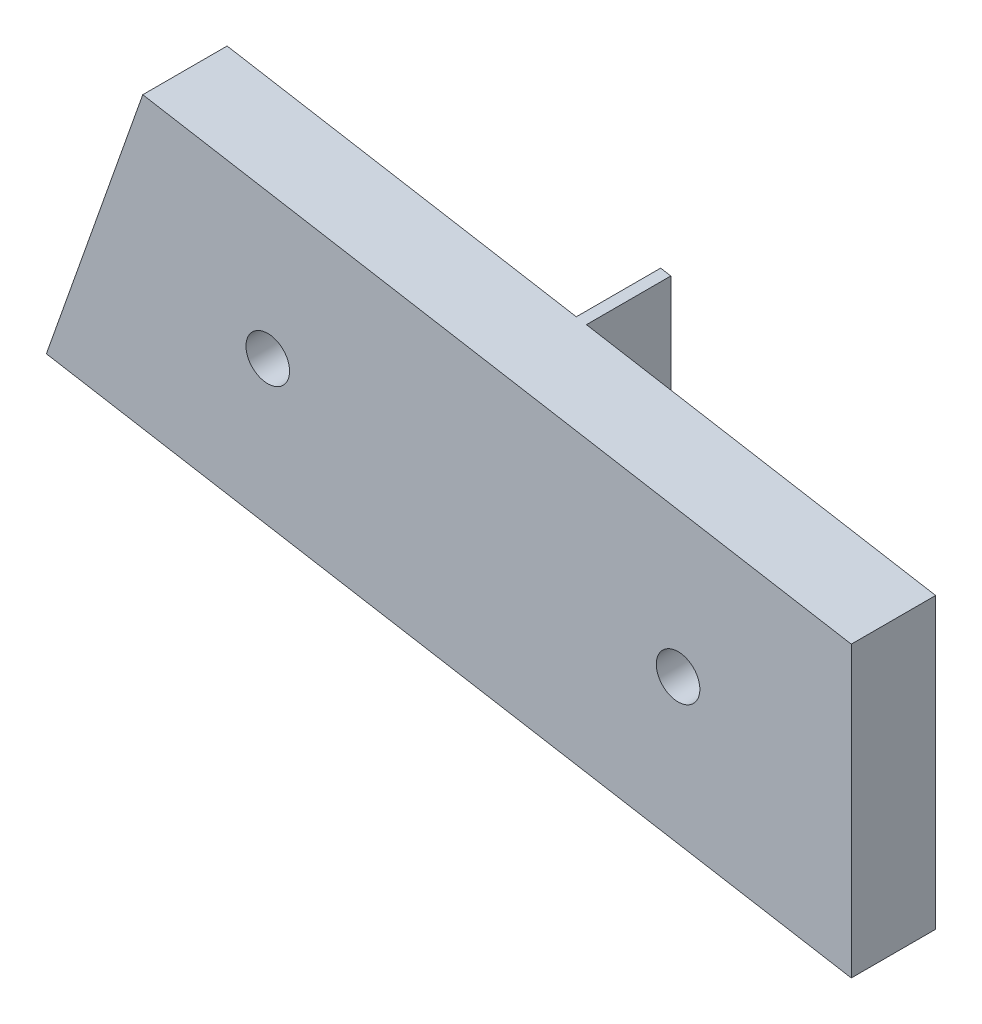
ISO-10303-21;
HEADER;
FILE_DESCRIPTION(('STEP AP214'),'2;1');
FILE_NAME('part.step','',(''),(''),'','','');
FILE_SCHEMA(('AUTOMOTIVE_DESIGN { 1 0 10303 214 1 1 1 1 }'));
ENDSEC;
DATA;
#1=APPLICATION_CONTEXT('core data for automotive mechanical design processes');
#2=APPLICATION_PROTOCOL_DEFINITION('international standard','automotive_design',2000,#1);
#3=PRODUCT_CONTEXT('',#1,'mechanical');
#4=PRODUCT('Part','Part','',(#3));
#5=PRODUCT_RELATED_PRODUCT_CATEGORY('part','',(#4));
#6=PRODUCT_DEFINITION_FORMATION('','',#4);
#7=PRODUCT_DEFINITION_CONTEXT('part definition',#1,'design');
#8=PRODUCT_DEFINITION('design','',#6,#7);
#9=PRODUCT_DEFINITION_SHAPE('','',#8);
#10=(LENGTH_UNIT() NAMED_UNIT(*) SI_UNIT(.MILLI.,.METRE.));
#11=(NAMED_UNIT(*) PLANE_ANGLE_UNIT() SI_UNIT($,.RADIAN.));
#12=(NAMED_UNIT(*) SI_UNIT($,.STERADIAN.) SOLID_ANGLE_UNIT());
#13=UNCERTAINTY_MEASURE_WITH_UNIT(LENGTH_MEASURE(1.E-05),#10,'distance_accuracy_value','');
#14=(GEOMETRIC_REPRESENTATION_CONTEXT(3) GLOBAL_UNCERTAINTY_ASSIGNED_CONTEXT((#13)) GLOBAL_UNIT_ASSIGNED_CONTEXT((#10,
#11,#12)) REPRESENTATION_CONTEXT('',''));
#15=CARTESIAN_POINT('',(0.,0.,0.));
#16=DIRECTION('',(0.,0.,1.));
#17=DIRECTION('',(1.,0.,0.));
#18=AXIS2_PLACEMENT_3D('',#15,#16,#17);
#19=CARTESIAN_POINT('',(0.,0.,0.));
#20=DIRECTION('',(0.,0.,-1.));
#21=DIRECTION('',(-1.,0.,0.));
#22=AXIS2_PLACEMENT_3D('',#19,#20,#21);
#23=PLANE('',#22);
#24=CARTESIAN_POINT('',(-155.827251007202,143.218500086852,0.));
#25=DIRECTION('',(0.,0.,-1.));
#26=DIRECTION('',(-1.,0.,0.));
#27=AXIS2_PLACEMENT_3D('',#24,#25,#26);
#28=CIRCLE('',#27,1.54999999999999);
#29=CARTESIAN_POINT('',(-157.377251007202,143.218500086852,0.));
#30=VERTEX_POINT('',#29);
#31=EDGE_CURVE('E161',#30,#30,#28,.T.);
#32=ORIENTED_EDGE('',*,*,#31,.F.);
#33=EDGE_LOOP('',(#32));
#34=FACE_BOUND('',#33,.T.);
#35=DIRECTION('',(0.333391923739183,0.942788324697271,0.));
#36=VECTOR('',#35,1.);
#37=CARTESIAN_POINT('',(-139.882193768128,150.764510209751,0.));
#38=LINE('',#37,#36);
#39=CARTESIAN_POINT('',(-146.738238305877,131.376521828693,0.));
#40=VERTEX_POINT('',#39);
#41=CARTESIAN_POINT('',(-139.882193768128,150.764510209751,0.));
#42=VERTEX_POINT('',#41);
#43=EDGE_CURVE('E121',#40,#42,#38,.T.);
#44=ORIENTED_EDGE('',*,*,#43,.F.);
#45=DIRECTION('',(0.985593304740158,-0.169132603750353,0.));
#46=VECTOR('',#45,1.);
#47=CARTESIAN_POINT('',(-114.323496857784,125.81399457263,0.));
#48=LINE('',#47,#46);
#49=CARTESIAN_POINT('',(-171.575189585329,135.638663443202,0.));
#50=VERTEX_POINT('',#49);
#51=EDGE_CURVE('E182',#50,#40,#48,.T.);
#52=ORIENTED_EDGE('',*,*,#51,.F.);
#53=DIRECTION('',(-0.333391923739182,-0.942788324697271,0.));
#54=VECTOR('',#53,1.);
#55=CARTESIAN_POINT('',(-171.575189585329,135.638663443202,0.));
#56=LINE('',#55,#54);
#57=CARTESIAN_POINT('',(-164.71914504758,155.02665182426,0.));
#58=VERTEX_POINT('',#57);
#59=EDGE_CURVE('E192',#58,#50,#56,.T.);
#60=ORIENTED_EDGE('',*,*,#59,.F.);
#61=DIRECTION('',(-0.985593304740157,0.169132603750358,0.));
#62=VECTOR('',#61,1.);
#63=CARTESIAN_POINT('',(-164.71914504758,155.02665182426,0.));
#64=LINE('',#63,#62);
#65=EDGE_CURVE('E50',#42,#58,#64,.T.);
#66=ORIENTED_EDGE('',*,*,#65,.F.);
#67=EDGE_LOOP('',(#44,#52,#60,#66));
#68=FACE_BOUND('',#67,.T.);
#69=ADVANCED_FACE('F33',(#34,#68),#23,.T.);
#70=CARTESIAN_POINT('',(-114.323496857784,146.37851353534,6.));
#71=DIRECTION('',(-1.,0.,0.));
#72=DIRECTION('',(0.,-1.,0.));
#73=AXIS2_PLACEMENT_3D('',#70,#71,#72);
#74=PLANE('',#73);
#75=DIRECTION('',(0.,1.,0.));
#76=VECTOR('',#75,1.);
#77=CARTESIAN_POINT('',(-114.323496857784,146.37851353534,0.));
#78=LINE('',#77,#76);
#79=CARTESIAN_POINT('',(-114.323496857784,125.81399457263,0.));
#80=VERTEX_POINT('',#79);
#81=CARTESIAN_POINT('',(-114.323496857784,146.37851353534,0.));
#82=VERTEX_POINT('',#81);
#83=EDGE_CURVE('E122',#80,#82,#78,.T.);
#84=ORIENTED_EDGE('',*,*,#83,.T.);
#85=DIRECTION('',(0.,0.,-1.));
#86=VECTOR('',#85,1.);
#87=CARTESIAN_POINT('',(-114.323496857784,146.37851353534,6.));
#88=LINE('',#87,#86);
#89=CARTESIAN_POINT('',(-114.323496857784,146.37851353534,6.));
#90=VERTEX_POINT('',#89);
#91=EDGE_CURVE('E11',#90,#82,#88,.T.);
#92=ORIENTED_EDGE('',*,*,#91,.F.);
#93=DIRECTION('',(0.,1.,0.));
#94=VECTOR('',#93,1.);
#95=CARTESIAN_POINT('',(-114.323496857784,146.37851353534,6.));
#96=LINE('',#95,#94);
#97=CARTESIAN_POINT('',(-114.323496857784,125.81399457263,6.));
#98=VERTEX_POINT('',#97);
#99=EDGE_CURVE('E142',#98,#90,#96,.T.);
#100=ORIENTED_EDGE('',*,*,#99,.F.);
#101=DIRECTION('',(0.,0.,-1.));
#102=VECTOR('',#101,1.);
#103=CARTESIAN_POINT('',(-114.323496857784,125.81399457263,6.));
#104=LINE('',#103,#102);
#105=EDGE_CURVE('E199',#98,#80,#104,.T.);
#106=ORIENTED_EDGE('',*,*,#105,.T.);
#107=EDGE_LOOP('',(#84,#92,#100,#106));
#108=FACE_BOUND('',#107,.T.);
#109=ADVANCED_FACE('F35',(#108),#74,.F.);
#110=CARTESIAN_POINT('',(-164.71914504758,155.02665182426,6.));
#111=DIRECTION('',(-0.169132603750358,-0.985593304740157,0.));
#112=DIRECTION('',(0.985593304740157,-0.169132603750358,0.));
#113=AXIS2_PLACEMENT_3D('',#110,#111,#112);
#114=PLANE('',#113);
#115=CARTESIAN_POINT('',(-139.160448137236,150.640655149849,0.));
#116=VERTEX_POINT('',#115);
#117=EDGE_CURVE('E210',#82,#116,#64,.T.);
#118=ORIENTED_EDGE('',*,*,#117,.T.);
#119=DIRECTION('',(0.,0.,1.));
#120=VECTOR('',#119,1.);
#121=CARTESIAN_POINT('',(-139.160448137236,150.640655149849,-6.));
#122=LINE('',#121,#120);
#123=CARTESIAN_POINT('',(-139.160448137236,150.640655149849,-6.));
#124=VERTEX_POINT('',#123);
#125=EDGE_CURVE('E106',#124,#116,#122,.T.);
#126=ORIENTED_EDGE('',*,*,#125,.F.);
#127=DIRECTION('',(0.985593304740162,-0.16913260375033,0.));
#128=VECTOR('',#127,1.);
#129=CARTESIAN_POINT('',(-139.160448137236,150.640655149849,-6.));
#130=LINE('',#129,#128);
#131=CARTESIAN_POINT('',(-139.882193768128,150.764510209751,-6.));
#132=VERTEX_POINT('',#131);
#133=EDGE_CURVE('E99',#132,#124,#130,.T.);
#134=ORIENTED_EDGE('',*,*,#133,.F.);
#135=DIRECTION('',(0.,0.,1.));
#136=VECTOR('',#135,1.);
#137=CARTESIAN_POINT('',(-139.882193768128,150.764510209751,-6.));
#138=LINE('',#137,#136);
#139=EDGE_CURVE('E103',#132,#42,#138,.T.);
#140=ORIENTED_EDGE('',*,*,#139,.T.);
#141=ORIENTED_EDGE('',*,*,#65,.T.);
#142=DIRECTION('',(0.,0.,-1.));
#143=VECTOR('',#142,1.);
#144=CARTESIAN_POINT('',(-164.71914504758,155.02665182426,6.));
#145=LINE('',#144,#143);
#146=CARTESIAN_POINT('',(-164.71914504758,155.02665182426,6.));
#147=VERTEX_POINT('',#146);
#148=EDGE_CURVE('E42',#147,#58,#145,.T.);
#149=ORIENTED_EDGE('',*,*,#148,.F.);
#150=DIRECTION('',(-0.985593304740157,0.169132603750358,0.));
#151=VECTOR('',#150,1.);
#152=CARTESIAN_POINT('',(-164.71914504758,155.02665182426,6.));
#153=LINE('',#152,#151);
#154=EDGE_CURVE('E191',#90,#147,#153,.T.);
#155=ORIENTED_EDGE('',*,*,#154,.F.);
#156=ORIENTED_EDGE('',*,*,#91,.T.);
#157=EDGE_LOOP('',(#118,#126,#134,#140,#141,#149,#155,#156));
#158=FACE_BOUND('',#157,.T.);
#159=ADVANCED_FACE('F101',(#158),#114,.F.);
#160=CARTESIAN_POINT('',(-171.575189585329,135.638663443202,6.));
#161=DIRECTION('',(0.942788324697271,-0.333391923739182,0.));
#162=DIRECTION('',(0.333391923739182,0.942788324697271,0.));
#163=AXIS2_PLACEMENT_3D('',#160,#161,#162);
#164=PLANE('',#163);
#165=ORIENTED_EDGE('',*,*,#59,.T.);
#166=DIRECTION('',(0.,0.,-1.));
#167=VECTOR('',#166,1.);
#168=CARTESIAN_POINT('',(-171.575189585329,135.638663443202,6.));
#169=LINE('',#168,#167);
#170=CARTESIAN_POINT('',(-171.575189585329,135.638663443202,6.));
#171=VERTEX_POINT('',#170);
#172=EDGE_CURVE('E187',#171,#50,#169,.T.);
#173=ORIENTED_EDGE('',*,*,#172,.F.);
#174=DIRECTION('',(-0.333391923739182,-0.942788324697271,0.));
#175=VECTOR('',#174,1.);
#176=CARTESIAN_POINT('',(-171.575189585329,135.638663443202,6.));
#177=LINE('',#176,#175);
#178=EDGE_CURVE('E209',#147,#171,#177,.T.);
#179=ORIENTED_EDGE('',*,*,#178,.F.);
#180=ORIENTED_EDGE('',*,*,#148,.T.);
#181=EDGE_LOOP('',(#165,#173,#179,#180));
#182=FACE_BOUND('',#181,.T.);
#183=ADVANCED_FACE('F208',(#182),#164,.F.);
#184=CARTESIAN_POINT('',(-114.323496857784,125.81399457263,6.));
#185=DIRECTION('',(0.169132603750353,0.985593304740158,0.));
#186=DIRECTION('',(-0.985593304740158,0.169132603750353,0.));
#187=AXIS2_PLACEMENT_3D('',#184,#185,#186);
#188=PLANE('',#187);
#189=ORIENTED_EDGE('',*,*,#51,.T.);
#190=DIRECTION('',(0.,0.,1.));
#191=VECTOR('',#190,1.);
#192=CARTESIAN_POINT('',(-146.738238305877,131.376521828693,-6.));
#193=LINE('',#192,#191);
#194=CARTESIAN_POINT('',(-146.738238305877,131.376521828693,-6.));
#195=VERTEX_POINT('',#194);
#196=EDGE_CURVE('E135',#195,#40,#193,.T.);
#197=ORIENTED_EDGE('',*,*,#196,.F.);
#198=DIRECTION('',(-0.985593304740158,0.169132603750354,0.));
#199=VECTOR('',#198,1.);
#200=CARTESIAN_POINT('',(-146.738238305877,131.376521828693,-6.));
#201=LINE('',#200,#199);
#202=CARTESIAN_POINT('',(-139.160448137236,130.076136187139,-6.));
#203=VERTEX_POINT('',#202);
#204=EDGE_CURVE('E115',#203,#195,#201,.T.);
#205=ORIENTED_EDGE('',*,*,#204,.F.);
#206=DIRECTION('',(0.,0.,1.));
#207=VECTOR('',#206,1.);
#208=CARTESIAN_POINT('',(-139.160448137236,130.076136187139,-6.));
#209=LINE('',#208,#207);
#210=CARTESIAN_POINT('',(-139.160448137236,130.076136187139,0.));
#211=VERTEX_POINT('',#210);
#212=EDGE_CURVE('E126',#203,#211,#209,.T.);
#213=ORIENTED_EDGE('',*,*,#212,.T.);
#214=EDGE_CURVE('E188',#211,#80,#48,.T.);
#215=ORIENTED_EDGE('',*,*,#214,.T.);
#216=ORIENTED_EDGE('',*,*,#105,.F.);
#217=DIRECTION('',(0.985593304740158,-0.169132603750353,0.));
#218=VECTOR('',#217,1.);
#219=CARTESIAN_POINT('',(-114.323496857784,125.81399457263,6.));
#220=LINE('',#219,#218);
#221=EDGE_CURVE('E203',#171,#98,#220,.T.);
#222=ORIENTED_EDGE('',*,*,#221,.F.);
#223=ORIENTED_EDGE('',*,*,#172,.T.);
#224=EDGE_LOOP('',(#189,#197,#205,#213,#215,#216,#222,#223));
#225=FACE_BOUND('',#224,.T.);
#226=ADVANCED_FACE('F184',(#225),#188,.F.);
#227=CARTESIAN_POINT('',(0.,0.,6.));
#228=DIRECTION('',(0.,0.,-1.));
#229=DIRECTION('',(-1.,0.,0.));
#230=AXIS2_PLACEMENT_3D('',#227,#228,#229);
#231=PLANE('',#230);
#232=CARTESIAN_POINT('',(-155.827251007202,143.218500086852,6.));
#233=DIRECTION('',(0.,0.,-1.));
#234=DIRECTION('',(-1.,0.,0.));
#235=AXIS2_PLACEMENT_3D('',#232,#233,#234);
#236=CIRCLE('',#235,1.54999999999999);
#237=CARTESIAN_POINT('',(-157.377251007202,143.218500086852,6.));
#238=VERTEX_POINT('',#237);
#239=EDGE_CURVE('E158',#238,#238,#236,.T.);
#240=ORIENTED_EDGE('',*,*,#239,.T.);
#241=EDGE_LOOP('',(#240));
#242=FACE_BOUND('',#241,.T.);
#243=CARTESIAN_POINT('',(-126.643413167036,138.210411600864,6.));
#244=DIRECTION('',(0.,0.,-1.));
#245=DIRECTION('',(-1.,0.,0.));
#246=AXIS2_PLACEMENT_3D('',#243,#244,#245);
#247=CIRCLE('',#246,1.55000000000002);
#248=CARTESIAN_POINT('',(-128.193413167036,138.210411600864,6.));
#249=VERTEX_POINT('',#248);
#250=EDGE_CURVE('E134',#249,#249,#247,.T.);
#251=ORIENTED_EDGE('',*,*,#250,.T.);
#252=EDGE_LOOP('',(#251));
#253=FACE_BOUND('',#252,.T.);
#254=ORIENTED_EDGE('',*,*,#99,.T.);
#255=ORIENTED_EDGE('',*,*,#154,.T.);
#256=ORIENTED_EDGE('',*,*,#178,.T.);
#257=ORIENTED_EDGE('',*,*,#221,.T.);
#258=EDGE_LOOP('',(#254,#255,#256,#257));
#259=FACE_BOUND('',#258,.T.);
#260=ADVANCED_FACE('F167',(#242,#253,#259),#231,.F.);
#261=CARTESIAN_POINT('',(-126.643413167036,138.210411600864,0.));
#262=DIRECTION('',(0.,0.,-1.));
#263=DIRECTION('',(-1.,0.,0.));
#264=AXIS2_PLACEMENT_3D('',#261,#262,#263);
#265=CIRCLE('',#264,1.55000000000002);
#266=CARTESIAN_POINT('',(-128.193413167036,138.210411600864,0.));
#267=VERTEX_POINT('',#266);
#268=EDGE_CURVE('E155',#267,#267,#265,.T.);
#269=ORIENTED_EDGE('',*,*,#268,.F.);
#270=EDGE_LOOP('',(#269));
#271=FACE_BOUND('',#270,.T.);
#272=DIRECTION('',(0.,-1.,0.));
#273=VECTOR('',#272,1.);
#274=CARTESIAN_POINT('',(-139.160448137236,130.076136187139,0.));
#275=LINE('',#274,#273);
#276=EDGE_CURVE('E58',#116,#211,#275,.T.);
#277=ORIENTED_EDGE('',*,*,#276,.F.);
#278=ORIENTED_EDGE('',*,*,#117,.F.);
#279=ORIENTED_EDGE('',*,*,#83,.F.);
#280=ORIENTED_EDGE('',*,*,#214,.F.);
#281=EDGE_LOOP('',(#277,#278,#279,#280));
#282=FACE_BOUND('',#281,.T.);
#283=ADVANCED_FACE('F179',(#271,#282),#23,.T.);
#284=CARTESIAN_POINT('',(-139.882193768128,150.764510209751,-6.));
#285=DIRECTION('',(0.942788324697271,-0.333391923739183,0.));
#286=DIRECTION('',(0.333391923739183,0.942788324697271,0.));
#287=AXIS2_PLACEMENT_3D('',#284,#285,#286);
#288=PLANE('',#287);
#289=ORIENTED_EDGE('',*,*,#43,.T.);
#290=ORIENTED_EDGE('',*,*,#139,.F.);
#291=DIRECTION('',(0.333391923739183,0.942788324697271,0.));
#292=VECTOR('',#291,1.);
#293=CARTESIAN_POINT('',(-139.882193768128,150.764510209751,-6.));
#294=LINE('',#293,#292);
#295=EDGE_CURVE('E110',#195,#132,#294,.T.);
#296=ORIENTED_EDGE('',*,*,#295,.F.);
#297=ORIENTED_EDGE('',*,*,#196,.T.);
#298=EDGE_LOOP('',(#289,#290,#296,#297));
#299=FACE_BOUND('',#298,.T.);
#300=ADVANCED_FACE('F120',(#299),#288,.F.);
#301=CARTESIAN_POINT('',(-139.160448137236,130.076136187139,-6.));
#302=DIRECTION('',(-1.,0.,0.));
#303=DIRECTION('',(0.,-1.,0.));
#304=AXIS2_PLACEMENT_3D('',#301,#302,#303);
#305=PLANE('',#304);
#306=ORIENTED_EDGE('',*,*,#276,.T.);
#307=ORIENTED_EDGE('',*,*,#212,.F.);
#308=DIRECTION('',(0.,-1.,0.));
#309=VECTOR('',#308,1.);
#310=CARTESIAN_POINT('',(-139.160448137236,130.076136187139,-6.));
#311=LINE('',#310,#309);
#312=EDGE_CURVE('E109',#124,#203,#311,.T.);
#313=ORIENTED_EDGE('',*,*,#312,.F.);
#314=ORIENTED_EDGE('',*,*,#125,.T.);
#315=EDGE_LOOP('',(#306,#307,#313,#314));
#316=FACE_BOUND('',#315,.T.);
#317=ADVANCED_FACE('F222',(#316),#305,.F.);
#318=CARTESIAN_POINT('',(0.,0.,-6.));
#319=DIRECTION('',(0.,0.,1.));
#320=DIRECTION('',(1.,0.,0.));
#321=AXIS2_PLACEMENT_3D('',#318,#319,#320);
#322=PLANE('',#321);
#323=ORIENTED_EDGE('',*,*,#295,.T.);
#324=ORIENTED_EDGE('',*,*,#133,.T.);
#325=ORIENTED_EDGE('',*,*,#312,.T.);
#326=ORIENTED_EDGE('',*,*,#204,.T.);
#327=EDGE_LOOP('',(#323,#324,#325,#326));
#328=FACE_BOUND('',#327,.T.);
#329=ADVANCED_FACE('F113',(#328),#322,.F.);
#330=CARTESIAN_POINT('',(-126.643413167036,138.210411600864,6.));
#331=DIRECTION('',(0.,0.,-1.));
#332=DIRECTION('',(-1.,0.,0.));
#333=AXIS2_PLACEMENT_3D('',#330,#331,#332);
#334=CYLINDRICAL_SURFACE('',#333,1.55000000000002);
#335=ORIENTED_EDGE('',*,*,#250,.F.);
#336=EDGE_LOOP('',(#335));
#337=FACE_BOUND('',#336,.T.);
#338=ORIENTED_EDGE('',*,*,#268,.T.);
#339=EDGE_LOOP('',(#338));
#340=FACE_BOUND('',#339,.T.);
#341=ADVANCED_FACE('F173',(#337,#340),#334,.F.);
#342=CARTESIAN_POINT('',(-155.827251007202,143.218500086852,6.));
#343=DIRECTION('',(0.,0.,-1.));
#344=DIRECTION('',(-1.,0.,0.));
#345=AXIS2_PLACEMENT_3D('',#342,#343,#344);
#346=CYLINDRICAL_SURFACE('',#345,1.54999999999999);
#347=ORIENTED_EDGE('',*,*,#239,.F.);
#348=EDGE_LOOP('',(#347));
#349=FACE_BOUND('',#348,.T.);
#350=ORIENTED_EDGE('',*,*,#31,.T.);
#351=EDGE_LOOP('',(#350));
#352=FACE_BOUND('',#351,.T.);
#353=ADVANCED_FACE('F170',(#349,#352),#346,.F.);
#354=CLOSED_SHELL('',(#69,#109,#159,#183,#226,#260,#283,#300,#317,#329,#341,#353));
#355=MANIFOLD_SOLID_BREP('B2',#354);
#356=ADVANCED_BREP_SHAPE_REPRESENTATION('',(#18,#355),#14);
#357=SHAPE_DEFINITION_REPRESENTATION(#9,#356);
ENDSEC;
END-ISO-10303-21;
